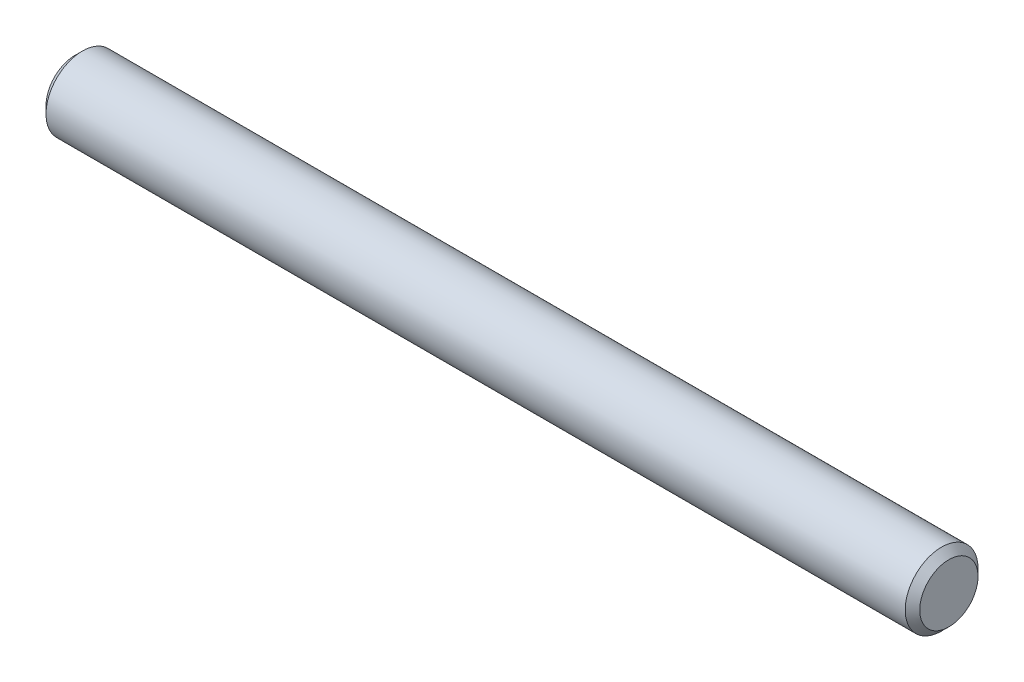
ISO-10303-21;
HEADER;
FILE_DESCRIPTION(('STEP AP214'),'2;1');
FILE_NAME('part.step','',(''),(''),'','','');
FILE_SCHEMA(('AUTOMOTIVE_DESIGN { 1 0 10303 214 1 1 1 1 }'));
ENDSEC;
DATA;
#1=APPLICATION_CONTEXT('core data for automotive mechanical design processes');
#2=APPLICATION_PROTOCOL_DEFINITION('international standard','automotive_design',2000,#1);
#3=PRODUCT_CONTEXT('',#1,'mechanical');
#4=PRODUCT('Part','Part','',(#3));
#5=PRODUCT_RELATED_PRODUCT_CATEGORY('part','',(#4));
#6=PRODUCT_DEFINITION_FORMATION('','',#4);
#7=PRODUCT_DEFINITION_CONTEXT('part definition',#1,'design');
#8=PRODUCT_DEFINITION('design','',#6,#7);
#9=PRODUCT_DEFINITION_SHAPE('','',#8);
#10=(LENGTH_UNIT() NAMED_UNIT(*) SI_UNIT(.MILLI.,.METRE.));
#11=(NAMED_UNIT(*) PLANE_ANGLE_UNIT() SI_UNIT($,.RADIAN.));
#12=(NAMED_UNIT(*) SI_UNIT($,.STERADIAN.) SOLID_ANGLE_UNIT());
#13=UNCERTAINTY_MEASURE_WITH_UNIT(LENGTH_MEASURE(1.E-05),#10,'distance_accuracy_value','');
#14=(GEOMETRIC_REPRESENTATION_CONTEXT(3) GLOBAL_UNCERTAINTY_ASSIGNED_CONTEXT((#13)) GLOBAL_UNIT_ASSIGNED_CONTEXT((#10,
#11,#12)) REPRESENTATION_CONTEXT('',''));
#15=CARTESIAN_POINT('',(0.,0.,0.));
#16=DIRECTION('',(0.,0.,1.));
#17=DIRECTION('',(1.,0.,0.));
#18=AXIS2_PLACEMENT_3D('',#15,#16,#17);
#19=CARTESIAN_POINT('',(-19.05,0.,0.));
#20=DIRECTION('',(1.,0.,0.));
#21=DIRECTION('',(0.,0.,-1.));
#22=AXIS2_PLACEMENT_3D('',#19,#20,#21);
#23=CYLINDRICAL_SURFACE('',#22,1.5875);
#24=CARTESIAN_POINT('',(18.7325,0.,0.));
#25=DIRECTION('',(1.,0.,0.));
#26=DIRECTION('',(0.,0.,-1.));
#27=AXIS2_PLACEMENT_3D('',#24,#25,#26);
#28=CIRCLE('',#27,1.5875);
#29=CARTESIAN_POINT('',(18.7325,0.,-1.5875));
#30=VERTEX_POINT('',#29);
#31=EDGE_CURVE('E44',#30,#30,#28,.F.);
#32=ORIENTED_EDGE('',*,*,#31,.T.);
#33=EDGE_LOOP('',(#32));
#34=FACE_BOUND('',#33,.T.);
#35=CARTESIAN_POINT('',(-18.7325,0.,0.));
#36=DIRECTION('',(1.,0.,0.));
#37=DIRECTION('',(0.,0.,-1.));
#38=AXIS2_PLACEMENT_3D('',#35,#36,#37);
#39=CIRCLE('',#38,1.5875);
#40=CARTESIAN_POINT('',(-18.7325,0.,-1.5875));
#41=VERTEX_POINT('',#40);
#42=EDGE_CURVE('E50',#41,#41,#39,.T.);
#43=ORIENTED_EDGE('',*,*,#42,.T.);
#44=EDGE_LOOP('',(#43));
#45=FACE_BOUND('',#44,.T.);
#46=ADVANCED_FACE('F36',(#34,#45),#23,.T.);
#47=CARTESIAN_POINT('',(-19.05,0.,0.));
#48=DIRECTION('',(1.,0.,0.));
#49=DIRECTION('',(0.,0.,-1.));
#50=AXIS2_PLACEMENT_3D('',#47,#48,#49);
#51=PLANE('',#50);
#52=CARTESIAN_POINT('',(-19.05,0.,0.));
#53=DIRECTION('',(1.,0.,0.));
#54=DIRECTION('',(0.,0.,-1.));
#55=AXIS2_PLACEMENT_3D('',#52,#53,#54);
#56=CIRCLE('',#55,1.26999999999998);
#57=CARTESIAN_POINT('',(-19.05,0.,-1.26999999999998));
#58=VERTEX_POINT('',#57);
#59=EDGE_CURVE('E10',#58,#58,#56,.F.);
#60=ORIENTED_EDGE('',*,*,#59,.T.);
#61=EDGE_LOOP('',(#60));
#62=FACE_BOUND('',#61,.T.);
#63=ADVANCED_FACE('F71',(#62),#51,.F.);
#64=CARTESIAN_POINT('',(19.05,0.,0.));
#65=DIRECTION('',(1.,0.,0.));
#66=DIRECTION('',(0.,0.,-1.));
#67=AXIS2_PLACEMENT_3D('',#64,#65,#66);
#68=PLANE('',#67);
#69=CARTESIAN_POINT('',(19.05,0.,0.));
#70=DIRECTION('',(1.,0.,0.));
#71=DIRECTION('',(0.,0.,-1.));
#72=AXIS2_PLACEMENT_3D('',#69,#70,#71);
#73=CIRCLE('',#72,1.27);
#74=CARTESIAN_POINT('',(19.05,0.,-1.27));
#75=VERTEX_POINT('',#74);
#76=EDGE_CURVE('E55',#75,#75,#73,.T.);
#77=ORIENTED_EDGE('',*,*,#76,.T.);
#78=EDGE_LOOP('',(#77));
#79=FACE_BOUND('',#78,.T.);
#80=ADVANCED_FACE('F61',(#79),#68,.T.);
#81=CARTESIAN_POINT('',(19.05,0.,0.));
#82=DIRECTION('',(-1.,0.,0.));
#83=DIRECTION('',(0.,0.,1.));
#84=AXIS2_PLACEMENT_3D('',#81,#82,#83);
#85=CONICAL_SURFACE('',#84,1.27,0.785398163397462);
#86=ORIENTED_EDGE('',*,*,#31,.F.);
#87=EDGE_LOOP('',(#86));
#88=FACE_BOUND('',#87,.T.);
#89=ORIENTED_EDGE('',*,*,#76,.F.);
#90=EDGE_LOOP('',(#89));
#91=FACE_BOUND('',#90,.T.);
#92=ADVANCED_FACE('F63',(#88,#91),#85,.T.);
#93=CARTESIAN_POINT('',(-18.7325,0.,0.));
#94=DIRECTION('',(1.,0.,0.));
#95=DIRECTION('',(0.,0.,-1.));
#96=AXIS2_PLACEMENT_3D('',#93,#94,#95);
#97=CONICAL_SURFACE('',#96,1.5875,0.785398163397445);
#98=ORIENTED_EDGE('',*,*,#59,.F.);
#99=EDGE_LOOP('',(#98));
#100=FACE_BOUND('',#99,.T.);
#101=ORIENTED_EDGE('',*,*,#42,.F.);
#102=EDGE_LOOP('',(#101));
#103=FACE_BOUND('',#102,.T.);
#104=ADVANCED_FACE('F38',(#100,#103),#97,.T.);
#105=CLOSED_SHELL('',(#46,#63,#80,#92,#104));
#106=MANIFOLD_SOLID_BREP('B2',#105);
#107=ADVANCED_BREP_SHAPE_REPRESENTATION('',(#18,#106),#14);
#108=SHAPE_DEFINITION_REPRESENTATION(#9,#107);
ENDSEC;
END-ISO-10303-21;
